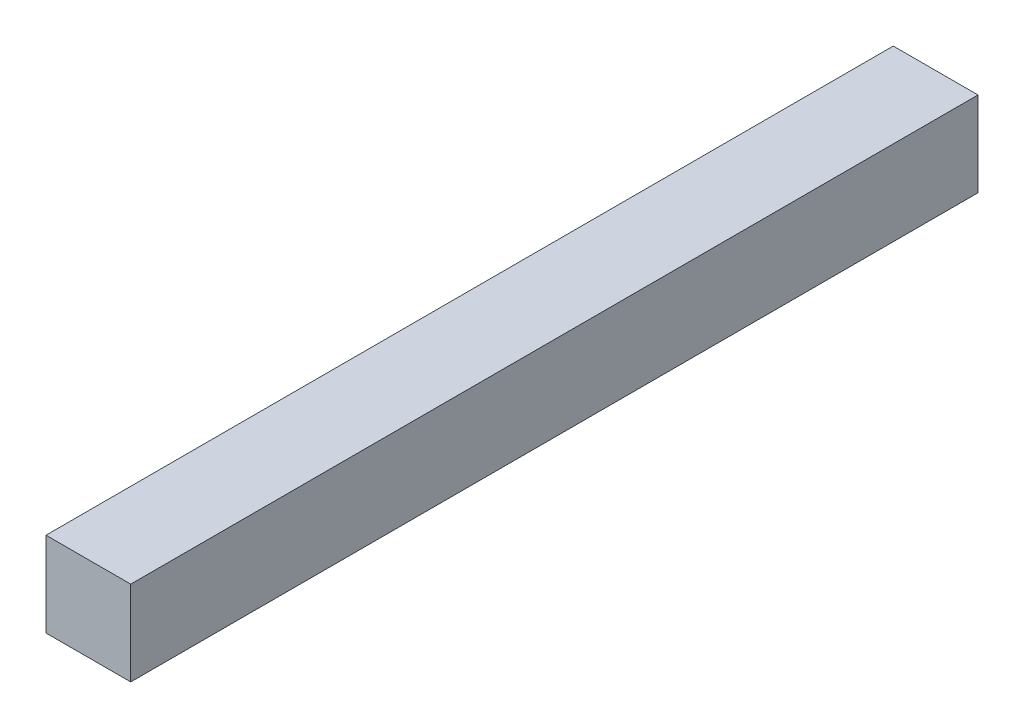
ISO-10303-21;
HEADER;
FILE_DESCRIPTION(('STEP AP214'),'2;1');
FILE_NAME('part.step','',(''),(''),'','','');
FILE_SCHEMA(('AUTOMOTIVE_DESIGN { 1 0 10303 214 1 1 1 1 }'));
ENDSEC;
DATA;
#1=APPLICATION_CONTEXT('core data for automotive mechanical design processes');
#2=APPLICATION_PROTOCOL_DEFINITION('international standard','automotive_design',2000,#1);
#3=PRODUCT_CONTEXT('',#1,'mechanical');
#4=PRODUCT('Part','Part','',(#3));
#5=PRODUCT_RELATED_PRODUCT_CATEGORY('part','',(#4));
#6=PRODUCT_DEFINITION_FORMATION('','',#4);
#7=PRODUCT_DEFINITION_CONTEXT('part definition',#1,'design');
#8=PRODUCT_DEFINITION('design','',#6,#7);
#9=PRODUCT_DEFINITION_SHAPE('','',#8);
#10=(LENGTH_UNIT() NAMED_UNIT(*) SI_UNIT(.MILLI.,.METRE.));
#11=(NAMED_UNIT(*) PLANE_ANGLE_UNIT() SI_UNIT($,.RADIAN.));
#12=(NAMED_UNIT(*) SI_UNIT($,.STERADIAN.) SOLID_ANGLE_UNIT());
#13=UNCERTAINTY_MEASURE_WITH_UNIT(LENGTH_MEASURE(1.E-05),#10,'distance_accuracy_value','');
#14=(GEOMETRIC_REPRESENTATION_CONTEXT(3) GLOBAL_UNCERTAINTY_ASSIGNED_CONTEXT((#13)) GLOBAL_UNIT_ASSIGNED_CONTEXT((#10,
#11,#12)) REPRESENTATION_CONTEXT('',''));
#15=CARTESIAN_POINT('',(0.,0.,0.));
#16=DIRECTION('',(0.,0.,1.));
#17=DIRECTION('',(1.,0.,0.));
#18=AXIS2_PLACEMENT_3D('',#15,#16,#17);
#19=CARTESIAN_POINT('',(1.5,1.5,30.));
#20=DIRECTION('',(-1.,0.,0.));
#21=DIRECTION('',(0.,-1.,0.));
#22=AXIS2_PLACEMENT_3D('',#19,#20,#21);
#23=PLANE('',#22);
#24=DIRECTION('',(0.,1.,0.));
#25=VECTOR('',#24,1.);
#26=CARTESIAN_POINT('',(1.5,1.5,0.));
#27=LINE('',#26,#25);
#28=CARTESIAN_POINT('',(1.5,-1.5,0.));
#29=VERTEX_POINT('',#28);
#30=CARTESIAN_POINT('',(1.5,1.5,0.));
#31=VERTEX_POINT('',#30);
#32=EDGE_CURVE('E107',#29,#31,#27,.T.);
#33=ORIENTED_EDGE('',*,*,#32,.T.);
#34=DIRECTION('',(0.,0.,-1.));
#35=VECTOR('',#34,1.);
#36=CARTESIAN_POINT('',(1.5,1.5,30.));
#37=LINE('',#36,#35);
#38=CARTESIAN_POINT('',(1.5,1.5,30.));
#39=VERTEX_POINT('',#38);
#40=EDGE_CURVE('E11',#39,#31,#37,.T.);
#41=ORIENTED_EDGE('',*,*,#40,.F.);
#42=DIRECTION('',(0.,1.,0.));
#43=VECTOR('',#42,1.);
#44=CARTESIAN_POINT('',(1.5,1.5,30.));
#45=LINE('',#44,#43);
#46=CARTESIAN_POINT('',(1.5,-1.5,30.));
#47=VERTEX_POINT('',#46);
#48=EDGE_CURVE('E91',#47,#39,#45,.T.);
#49=ORIENTED_EDGE('',*,*,#48,.F.);
#50=DIRECTION('',(0.,0.,-1.));
#51=VECTOR('',#50,1.);
#52=CARTESIAN_POINT('',(1.5,-1.5,30.));
#53=LINE('',#52,#51);
#54=EDGE_CURVE('E103',#47,#29,#53,.T.);
#55=ORIENTED_EDGE('',*,*,#54,.T.);
#56=EDGE_LOOP('',(#33,#41,#49,#55));
#57=FACE_BOUND('',#56,.T.);
#58=ADVANCED_FACE('F39',(#57),#23,.F.);
#59=CARTESIAN_POINT('',(-1.5,1.5,30.));
#60=DIRECTION('',(0.,-1.,0.));
#61=DIRECTION('',(0.,0.,-1.));
#62=AXIS2_PLACEMENT_3D('',#59,#60,#61);
#63=PLANE('',#62);
#64=DIRECTION('',(-1.,0.,0.));
#65=VECTOR('',#64,1.);
#66=CARTESIAN_POINT('',(-1.5,1.5,0.));
#67=LINE('',#66,#65);
#68=CARTESIAN_POINT('',(-1.5,1.5,0.));
#69=VERTEX_POINT('',#68);
#70=EDGE_CURVE('E96',#31,#69,#67,.T.);
#71=ORIENTED_EDGE('',*,*,#70,.T.);
#72=DIRECTION('',(0.,0.,-1.));
#73=VECTOR('',#72,1.);
#74=CARTESIAN_POINT('',(-1.5,1.5,30.));
#75=LINE('',#74,#73);
#76=CARTESIAN_POINT('',(-1.5,1.5,30.));
#77=VERTEX_POINT('',#76);
#78=EDGE_CURVE('E48',#77,#69,#75,.T.);
#79=ORIENTED_EDGE('',*,*,#78,.F.);
#80=DIRECTION('',(-1.,0.,0.));
#81=VECTOR('',#80,1.);
#82=CARTESIAN_POINT('',(-1.5,1.5,30.));
#83=LINE('',#82,#81);
#84=EDGE_CURVE('E86',#39,#77,#83,.T.);
#85=ORIENTED_EDGE('',*,*,#84,.F.);
#86=ORIENTED_EDGE('',*,*,#40,.T.);
#87=EDGE_LOOP('',(#71,#79,#85,#86));
#88=FACE_BOUND('',#87,.T.);
#89=ADVANCED_FACE('F95',(#88),#63,.F.);
#90=CARTESIAN_POINT('',(-1.5,1.5,30.));
#91=DIRECTION('',(1.,0.,0.));
#92=DIRECTION('',(0.,1.,0.));
#93=AXIS2_PLACEMENT_3D('',#90,#91,#92);
#94=PLANE('',#93);
#95=DIRECTION('',(0.,-1.,0.));
#96=VECTOR('',#95,1.);
#97=CARTESIAN_POINT('',(-1.5,1.5,0.));
#98=LINE('',#97,#96);
#99=CARTESIAN_POINT('',(-1.5,-1.5,0.));
#100=VERTEX_POINT('',#99);
#101=EDGE_CURVE('E73',#69,#100,#98,.T.);
#102=ORIENTED_EDGE('',*,*,#101,.T.);
#103=DIRECTION('',(0.,0.,-1.));
#104=VECTOR('',#103,1.);
#105=CARTESIAN_POINT('',(-1.5,-1.5,30.));
#106=LINE('',#105,#104);
#107=CARTESIAN_POINT('',(-1.5,-1.5,30.));
#108=VERTEX_POINT('',#107);
#109=EDGE_CURVE('E98',#108,#100,#106,.T.);
#110=ORIENTED_EDGE('',*,*,#109,.F.);
#111=DIRECTION('',(0.,-1.,0.));
#112=VECTOR('',#111,1.);
#113=CARTESIAN_POINT('',(-1.5,1.5,30.));
#114=LINE('',#113,#112);
#115=EDGE_CURVE('E89',#77,#108,#114,.T.);
#116=ORIENTED_EDGE('',*,*,#115,.F.);
#117=ORIENTED_EDGE('',*,*,#78,.T.);
#118=EDGE_LOOP('',(#102,#110,#116,#117));
#119=FACE_BOUND('',#118,.T.);
#120=ADVANCED_FACE('F99',(#119),#94,.F.);
#121=CARTESIAN_POINT('',(-1.5,-1.5,30.));
#122=DIRECTION('',(0.,1.,0.));
#123=DIRECTION('',(0.,0.,1.));
#124=AXIS2_PLACEMENT_3D('',#121,#122,#123);
#125=PLANE('',#124);
#126=DIRECTION('',(1.,0.,0.));
#127=VECTOR('',#126,1.);
#128=CARTESIAN_POINT('',(-1.5,-1.5,0.));
#129=LINE('',#128,#127);
#130=EDGE_CURVE('E79',#100,#29,#129,.T.);
#131=ORIENTED_EDGE('',*,*,#130,.T.);
#132=ORIENTED_EDGE('',*,*,#54,.F.);
#133=DIRECTION('',(1.,0.,0.));
#134=VECTOR('',#133,1.);
#135=CARTESIAN_POINT('',(-1.5,-1.5,30.));
#136=LINE('',#135,#134);
#137=EDGE_CURVE('E56',#108,#47,#136,.T.);
#138=ORIENTED_EDGE('',*,*,#137,.F.);
#139=ORIENTED_EDGE('',*,*,#109,.T.);
#140=EDGE_LOOP('',(#131,#132,#138,#139));
#141=FACE_BOUND('',#140,.T.);
#142=ADVANCED_FACE('F120',(#141),#125,.F.);
#143=CARTESIAN_POINT('',(0.,0.,30.));
#144=DIRECTION('',(0.,0.,1.));
#145=DIRECTION('',(1.,0.,0.));
#146=AXIS2_PLACEMENT_3D('',#143,#144,#145);
#147=PLANE('',#146);
#148=ORIENTED_EDGE('',*,*,#48,.T.);
#149=ORIENTED_EDGE('',*,*,#84,.T.);
#150=ORIENTED_EDGE('',*,*,#115,.T.);
#151=ORIENTED_EDGE('',*,*,#137,.T.);
#152=EDGE_LOOP('',(#148,#149,#150,#151));
#153=FACE_BOUND('',#152,.T.);
#154=ADVANCED_FACE('F87',(#153),#147,.T.);
#155=CARTESIAN_POINT('',(0.,0.,0.));
#156=DIRECTION('',(0.,0.,1.));
#157=DIRECTION('',(1.,0.,0.));
#158=AXIS2_PLACEMENT_3D('',#155,#156,#157);
#159=PLANE('',#158);
#160=ORIENTED_EDGE('',*,*,#32,.F.);
#161=ORIENTED_EDGE('',*,*,#130,.F.);
#162=ORIENTED_EDGE('',*,*,#101,.F.);
#163=ORIENTED_EDGE('',*,*,#70,.F.);
#164=EDGE_LOOP('',(#160,#161,#162,#163));
#165=FACE_BOUND('',#164,.T.);
#166=ADVANCED_FACE('F123',(#165),#159,.F.);
#167=CLOSED_SHELL('',(#58,#89,#120,#142,#154,#166));
#168=MANIFOLD_SOLID_BREP('B2',#167);
#169=ADVANCED_BREP_SHAPE_REPRESENTATION('',(#18,#168),#14);
#170=SHAPE_DEFINITION_REPRESENTATION(#9,#169);
ENDSEC;
END-ISO-10303-21;
